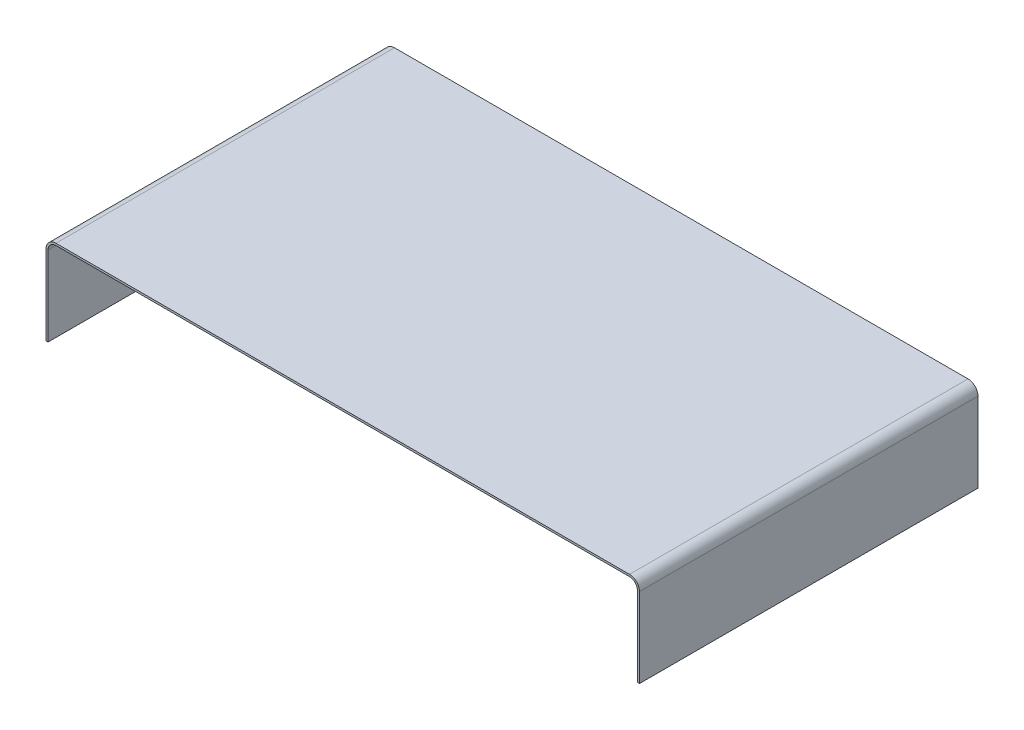
ISO-10303-21;
HEADER;
FILE_DESCRIPTION(('STEP AP214'),'2;1');
FILE_NAME('part.step','',(''),(''),'','','');
FILE_SCHEMA(('AUTOMOTIVE_DESIGN { 1 0 10303 214 1 1 1 1 }'));
ENDSEC;
DATA;
#1=APPLICATION_CONTEXT('core data for automotive mechanical design processes');
#2=APPLICATION_PROTOCOL_DEFINITION('international standard','automotive_design',2000,#1);
#3=PRODUCT_CONTEXT('',#1,'mechanical');
#4=PRODUCT('Part','Part','',(#3));
#5=PRODUCT_RELATED_PRODUCT_CATEGORY('part','',(#4));
#6=PRODUCT_DEFINITION_FORMATION('','',#4);
#7=PRODUCT_DEFINITION_CONTEXT('part definition',#1,'design');
#8=PRODUCT_DEFINITION('design','',#6,#7);
#9=PRODUCT_DEFINITION_SHAPE('','',#8);
#10=(LENGTH_UNIT() NAMED_UNIT(*) SI_UNIT(.MILLI.,.METRE.));
#11=(NAMED_UNIT(*) PLANE_ANGLE_UNIT() SI_UNIT($,.RADIAN.));
#12=(NAMED_UNIT(*) SI_UNIT($,.STERADIAN.) SOLID_ANGLE_UNIT());
#13=UNCERTAINTY_MEASURE_WITH_UNIT(LENGTH_MEASURE(1.E-05),#10,'distance_accuracy_value','');
#14=(GEOMETRIC_REPRESENTATION_CONTEXT(3) GLOBAL_UNCERTAINTY_ASSIGNED_CONTEXT((#13)) GLOBAL_UNIT_ASSIGNED_CONTEXT((#10,
#11,#12)) REPRESENTATION_CONTEXT('',''));
#15=CARTESIAN_POINT('',(0.,0.,0.));
#16=DIRECTION('',(0.,0.,1.));
#17=DIRECTION('',(1.,0.,0.));
#18=AXIS2_PLACEMENT_3D('',#15,#16,#17);
#19=CARTESIAN_POINT('',(0.,0.,170.));
#20=DIRECTION('',(0.,1.,0.));
#21=DIRECTION('',(0.,0.,1.));
#22=AXIS2_PLACEMENT_3D('',#19,#20,#21);
#23=PLANE('',#22);
#24=DIRECTION('',(1.,0.,0.));
#25=VECTOR('',#24,1.);
#26=CARTESIAN_POINT('',(0.,0.,0.));
#27=LINE('',#26,#25);
#28=CARTESIAN_POINT('',(0.,0.,0.));
#29=VERTEX_POINT('',#28);
#30=CARTESIAN_POINT('',(1.,0.,0.));
#31=VERTEX_POINT('',#30);
#32=EDGE_CURVE('E155',#29,#31,#27,.T.);
#33=ORIENTED_EDGE('',*,*,#32,.T.);
#34=DIRECTION('',(0.,0.,-1.));
#35=VECTOR('',#34,1.);
#36=CARTESIAN_POINT('',(1.,0.,170.));
#37=LINE('',#36,#35);
#38=CARTESIAN_POINT('',(1.,0.,170.));
#39=VERTEX_POINT('',#38);
#40=EDGE_CURVE('E11',#39,#31,#37,.T.);
#41=ORIENTED_EDGE('',*,*,#40,.F.);
#42=DIRECTION('',(1.,0.,0.));
#43=VECTOR('',#42,1.);
#44=CARTESIAN_POINT('',(0.,0.,170.));
#45=LINE('',#44,#43);
#46=CARTESIAN_POINT('',(0.,0.,170.));
#47=VERTEX_POINT('',#46);
#48=EDGE_CURVE('E177',#47,#39,#45,.T.);
#49=ORIENTED_EDGE('',*,*,#48,.F.);
#50=DIRECTION('',(0.,0.,-1.));
#51=VECTOR('',#50,1.);
#52=CARTESIAN_POINT('',(0.,0.,170.));
#53=LINE('',#52,#51);
#54=EDGE_CURVE('E151',#47,#29,#53,.T.);
#55=ORIENTED_EDGE('',*,*,#54,.T.);
#56=EDGE_LOOP('',(#33,#41,#49,#55));
#57=FACE_BOUND('',#56,.T.);
#58=ADVANCED_FACE('F35',(#57),#23,.F.);
#59=CARTESIAN_POINT('',(1.,0.,170.));
#60=DIRECTION('',(-1.,0.,0.));
#61=DIRECTION('',(0.,-1.,0.));
#62=AXIS2_PLACEMENT_3D('',#59,#60,#61);
#63=PLANE('',#62);
#64=DIRECTION('',(0.,1.,0.));
#65=VECTOR('',#64,1.);
#66=CARTESIAN_POINT('',(1.,0.,0.));
#67=LINE('',#66,#65);
#68=CARTESIAN_POINT('',(0.999999999999988,40.,0.));
#69=VERTEX_POINT('',#68);
#70=EDGE_CURVE('E158',#31,#69,#67,.T.);
#71=ORIENTED_EDGE('',*,*,#70,.T.);
#72=DIRECTION('',(0.,0.,-1.));
#73=VECTOR('',#72,1.);
#74=CARTESIAN_POINT('',(0.999999999999988,40.,170.));
#75=LINE('',#74,#73);
#76=CARTESIAN_POINT('',(0.999999999999988,40.,170.));
#77=VERTEX_POINT('',#76);
#78=EDGE_CURVE('E43',#77,#69,#75,.T.);
#79=ORIENTED_EDGE('',*,*,#78,.F.);
#80=DIRECTION('',(0.,1.,0.));
#81=VECTOR('',#80,1.);
#82=CARTESIAN_POINT('',(1.,0.,170.));
#83=LINE('',#82,#81);
#84=EDGE_CURVE('E106',#39,#77,#83,.T.);
#85=ORIENTED_EDGE('',*,*,#84,.F.);
#86=ORIENTED_EDGE('',*,*,#40,.T.);
#87=EDGE_LOOP('',(#71,#79,#85,#86));
#88=FACE_BOUND('',#87,.T.);
#89=ADVANCED_FACE('F255',(#88),#63,.F.);
#90=CARTESIAN_POINT('',(5.,40.,170.));
#91=DIRECTION('',(0.,0.,-1.));
#92=DIRECTION('',(-1.,0.,0.));
#93=AXIS2_PLACEMENT_3D('',#90,#91,#92);
#94=CYLINDRICAL_SURFACE('',#93,4.00000000000001);
#95=CARTESIAN_POINT('',(5.,40.,0.));
#96=DIRECTION('',(0.,0.,-1.));
#97=DIRECTION('',(1.,0.,0.));
#98=AXIS2_PLACEMENT_3D('',#95,#96,#97);
#99=CIRCLE('',#98,4.00000000000001);
#100=CARTESIAN_POINT('',(5.00000000000006,44.,0.));
#101=VERTEX_POINT('',#100);
#102=EDGE_CURVE('E160',#69,#101,#99,.T.);
#103=ORIENTED_EDGE('',*,*,#102,.T.);
#104=DIRECTION('',(0.,0.,-1.));
#105=VECTOR('',#104,1.);
#106=CARTESIAN_POINT('',(5.00000000000006,44.,170.));
#107=LINE('',#106,#105);
#108=CARTESIAN_POINT('',(5.00000000000006,44.,170.));
#109=VERTEX_POINT('',#108);
#110=EDGE_CURVE('E196',#109,#101,#107,.T.);
#111=ORIENTED_EDGE('',*,*,#110,.F.);
#112=CARTESIAN_POINT('',(5.,40.,170.));
#113=DIRECTION('',(0.,0.,-1.));
#114=DIRECTION('',(1.,0.,0.));
#115=AXIS2_PLACEMENT_3D('',#112,#113,#114);
#116=CIRCLE('',#115,4.00000000000001);
#117=EDGE_CURVE('E204',#77,#109,#116,.T.);
#118=ORIENTED_EDGE('',*,*,#117,.F.);
#119=ORIENTED_EDGE('',*,*,#78,.T.);
#120=EDGE_LOOP('',(#103,#111,#118,#119));
#121=FACE_BOUND('',#120,.T.);
#122=ADVANCED_FACE('F202',(#121),#94,.F.);
#123=CARTESIAN_POINT('',(293.,44.,170.));
#124=DIRECTION('',(0.,1.,0.));
#125=DIRECTION('',(-1.,0.,0.));
#126=AXIS2_PLACEMENT_3D('',#123,#124,#125);
#127=PLANE('',#126);
#128=DIRECTION('',(1.,0.,0.));
#129=VECTOR('',#128,1.);
#130=CARTESIAN_POINT('',(293.,44.,0.));
#131=LINE('',#130,#129);
#132=CARTESIAN_POINT('',(293.,44.,0.));
#133=VERTEX_POINT('',#132);
#134=EDGE_CURVE('E162',#101,#133,#131,.T.);
#135=ORIENTED_EDGE('',*,*,#134,.T.);
#136=DIRECTION('',(0.,0.,-1.));
#137=VECTOR('',#136,1.);
#138=CARTESIAN_POINT('',(293.,44.,170.));
#139=LINE('',#138,#137);
#140=CARTESIAN_POINT('',(293.,44.,170.));
#141=VERTEX_POINT('',#140);
#142=EDGE_CURVE('E193',#141,#133,#139,.T.);
#143=ORIENTED_EDGE('',*,*,#142,.F.);
#144=DIRECTION('',(1.,0.,0.));
#145=VECTOR('',#144,1.);
#146=CARTESIAN_POINT('',(293.,44.,170.));
#147=LINE('',#146,#145);
#148=EDGE_CURVE('E222',#109,#141,#147,.T.);
#149=ORIENTED_EDGE('',*,*,#148,.F.);
#150=ORIENTED_EDGE('',*,*,#110,.T.);
#151=EDGE_LOOP('',(#135,#143,#149,#150));
#152=FACE_BOUND('',#151,.T.);
#153=ADVANCED_FACE('F213',(#152),#127,.F.);
#154=CARTESIAN_POINT('',(293.,40.,170.));
#155=DIRECTION('',(0.,0.,-1.));
#156=DIRECTION('',(-1.,0.,0.));
#157=AXIS2_PLACEMENT_3D('',#154,#155,#156);
#158=CYLINDRICAL_SURFACE('',#157,4.);
#159=CARTESIAN_POINT('',(293.,40.,0.));
#160=DIRECTION('',(0.,0.,-1.));
#161=DIRECTION('',(-1.,0.,0.));
#162=AXIS2_PLACEMENT_3D('',#159,#160,#161);
#163=CIRCLE('',#162,4.);
#164=CARTESIAN_POINT('',(297.,40.,0.));
#165=VERTEX_POINT('',#164);
#166=EDGE_CURVE('E164',#133,#165,#163,.T.);
#167=ORIENTED_EDGE('',*,*,#166,.T.);
#168=DIRECTION('',(0.,0.,-1.));
#169=VECTOR('',#168,1.);
#170=CARTESIAN_POINT('',(297.,40.,170.));
#171=LINE('',#170,#169);
#172=CARTESIAN_POINT('',(297.,40.,170.));
#173=VERTEX_POINT('',#172);
#174=EDGE_CURVE('E190',#173,#165,#171,.T.);
#175=ORIENTED_EDGE('',*,*,#174,.F.);
#176=CARTESIAN_POINT('',(293.,40.,170.));
#177=DIRECTION('',(0.,0.,-1.));
#178=DIRECTION('',(-1.,0.,0.));
#179=AXIS2_PLACEMENT_3D('',#176,#177,#178);
#180=CIRCLE('',#179,4.);
#181=EDGE_CURVE('E219',#141,#173,#180,.T.);
#182=ORIENTED_EDGE('',*,*,#181,.F.);
#183=ORIENTED_EDGE('',*,*,#142,.T.);
#184=EDGE_LOOP('',(#167,#175,#182,#183));
#185=FACE_BOUND('',#184,.T.);
#186=ADVANCED_FACE('F217',(#185),#158,.F.);
#187=CARTESIAN_POINT('',(297.,0.,170.));
#188=DIRECTION('',(1.,0.,0.));
#189=DIRECTION('',(0.,0.,-1.));
#190=AXIS2_PLACEMENT_3D('',#187,#188,#189);
#191=PLANE('',#190);
#192=DIRECTION('',(0.,-1.,0.));
#193=VECTOR('',#192,1.);
#194=CARTESIAN_POINT('',(297.,0.,0.));
#195=LINE('',#194,#193);
#196=CARTESIAN_POINT('',(297.,0.,0.));
#197=VERTEX_POINT('',#196);
#198=EDGE_CURVE('E166',#165,#197,#195,.T.);
#199=ORIENTED_EDGE('',*,*,#198,.T.);
#200=DIRECTION('',(0.,0.,-1.));
#201=VECTOR('',#200,1.);
#202=CARTESIAN_POINT('',(297.,0.,170.));
#203=LINE('',#202,#201);
#204=CARTESIAN_POINT('',(297.,0.,170.));
#205=VERTEX_POINT('',#204);
#206=EDGE_CURVE('E187',#205,#197,#203,.T.);
#207=ORIENTED_EDGE('',*,*,#206,.F.);
#208=DIRECTION('',(0.,-1.,0.));
#209=VECTOR('',#208,1.);
#210=CARTESIAN_POINT('',(297.,0.,170.));
#211=LINE('',#210,#209);
#212=EDGE_CURVE('E221',#173,#205,#211,.T.);
#213=ORIENTED_EDGE('',*,*,#212,.F.);
#214=ORIENTED_EDGE('',*,*,#174,.T.);
#215=EDGE_LOOP('',(#199,#207,#213,#214));
#216=FACE_BOUND('',#215,.T.);
#217=ADVANCED_FACE('F268',(#216),#191,.F.);
#218=CARTESIAN_POINT('',(297.,0.,170.));
#219=DIRECTION('',(0.,1.,0.));
#220=DIRECTION('',(0.,0.,1.));
#221=AXIS2_PLACEMENT_3D('',#218,#219,#220);
#222=PLANE('',#221);
#223=DIRECTION('',(1.,0.,0.));
#224=VECTOR('',#223,1.);
#225=CARTESIAN_POINT('',(297.,0.,0.));
#226=LINE('',#225,#224);
#227=CARTESIAN_POINT('',(298.,0.,0.));
#228=VERTEX_POINT('',#227);
#229=EDGE_CURVE('E168',#197,#228,#226,.T.);
#230=ORIENTED_EDGE('',*,*,#229,.T.);
#231=DIRECTION('',(0.,0.,-1.));
#232=VECTOR('',#231,1.);
#233=CARTESIAN_POINT('',(298.,0.,170.));
#234=LINE('',#233,#232);
#235=CARTESIAN_POINT('',(298.,0.,170.));
#236=VERTEX_POINT('',#235);
#237=EDGE_CURVE('E184',#236,#228,#234,.T.);
#238=ORIENTED_EDGE('',*,*,#237,.F.);
#239=DIRECTION('',(1.,0.,0.));
#240=VECTOR('',#239,1.);
#241=CARTESIAN_POINT('',(297.,0.,170.));
#242=LINE('',#241,#240);
#243=EDGE_CURVE('E224',#205,#236,#242,.T.);
#244=ORIENTED_EDGE('',*,*,#243,.F.);
#245=ORIENTED_EDGE('',*,*,#206,.T.);
#246=EDGE_LOOP('',(#230,#238,#244,#245));
#247=FACE_BOUND('',#246,.T.);
#248=ADVANCED_FACE('F271',(#247),#222,.F.);
#249=CARTESIAN_POINT('',(298.,0.,170.));
#250=DIRECTION('',(-1.,0.,0.));
#251=DIRECTION('',(0.,0.,1.));
#252=AXIS2_PLACEMENT_3D('',#249,#250,#251);
#253=PLANE('',#252);
#254=DIRECTION('',(0.,1.,0.));
#255=VECTOR('',#254,1.);
#256=CARTESIAN_POINT('',(298.,0.,0.));
#257=LINE('',#256,#255);
#258=CARTESIAN_POINT('',(298.,40.,0.));
#259=VERTEX_POINT('',#258);
#260=EDGE_CURVE('E170',#228,#259,#257,.T.);
#261=ORIENTED_EDGE('',*,*,#260,.T.);
#262=DIRECTION('',(0.,0.,-1.));
#263=VECTOR('',#262,1.);
#264=CARTESIAN_POINT('',(298.,40.,170.));
#265=LINE('',#264,#263);
#266=CARTESIAN_POINT('',(298.,40.,170.));
#267=VERTEX_POINT('',#266);
#268=EDGE_CURVE('E181',#267,#259,#265,.T.);
#269=ORIENTED_EDGE('',*,*,#268,.F.);
#270=DIRECTION('',(0.,1.,0.));
#271=VECTOR('',#270,1.);
#272=CARTESIAN_POINT('',(298.,0.,170.));
#273=LINE('',#272,#271);
#274=EDGE_CURVE('E230',#236,#267,#273,.T.);
#275=ORIENTED_EDGE('',*,*,#274,.F.);
#276=ORIENTED_EDGE('',*,*,#237,.T.);
#277=EDGE_LOOP('',(#261,#269,#275,#276));
#278=FACE_BOUND('',#277,.T.);
#279=ADVANCED_FACE('F236',(#278),#253,.F.);
#280=CARTESIAN_POINT('',(293.,40.,170.));
#281=DIRECTION('',(0.,0.,-1.));
#282=DIRECTION('',(-1.,0.,0.));
#283=AXIS2_PLACEMENT_3D('',#280,#281,#282);
#284=CYLINDRICAL_SURFACE('',#283,5.);
#285=CARTESIAN_POINT('',(293.,40.,0.));
#286=DIRECTION('',(0.,0.,1.));
#287=DIRECTION('',(-1.,0.,0.));
#288=AXIS2_PLACEMENT_3D('',#285,#286,#287);
#289=CIRCLE('',#288,5.);
#290=CARTESIAN_POINT('',(293.,45.,0.));
#291=VERTEX_POINT('',#290);
#292=EDGE_CURVE('E172',#259,#291,#289,.T.);
#293=ORIENTED_EDGE('',*,*,#292,.T.);
#294=DIRECTION('',(0.,0.,-1.));
#295=VECTOR('',#294,1.);
#296=CARTESIAN_POINT('',(293.,45.,170.));
#297=LINE('',#296,#295);
#298=CARTESIAN_POINT('',(293.,45.,170.));
#299=VERTEX_POINT('',#298);
#300=EDGE_CURVE('E146',#299,#291,#297,.T.);
#301=ORIENTED_EDGE('',*,*,#300,.F.);
#302=CARTESIAN_POINT('',(293.,40.,170.));
#303=DIRECTION('',(0.,0.,1.));
#304=DIRECTION('',(-1.,0.,0.));
#305=AXIS2_PLACEMENT_3D('',#302,#303,#304);
#306=CIRCLE('',#305,5.);
#307=EDGE_CURVE('E137',#267,#299,#306,.T.);
#308=ORIENTED_EDGE('',*,*,#307,.F.);
#309=ORIENTED_EDGE('',*,*,#268,.T.);
#310=EDGE_LOOP('',(#293,#301,#308,#309));
#311=FACE_BOUND('',#310,.T.);
#312=ADVANCED_FACE('F240',(#311),#284,.T.);
#313=CARTESIAN_POINT('',(293.,45.,170.));
#314=DIRECTION('',(0.,-1.,0.));
#315=DIRECTION('',(1.,0.,0.));
#316=AXIS2_PLACEMENT_3D('',#313,#314,#315);
#317=PLANE('',#316);
#318=DIRECTION('',(-1.,0.,0.));
#319=VECTOR('',#318,1.);
#320=CARTESIAN_POINT('',(293.,45.,0.));
#321=LINE('',#320,#319);
#322=CARTESIAN_POINT('',(5.00000000000004,45.,0.));
#323=VERTEX_POINT('',#322);
#324=EDGE_CURVE('E145',#291,#323,#321,.T.);
#325=ORIENTED_EDGE('',*,*,#324,.T.);
#326=DIRECTION('',(0.,0.,-1.));
#327=VECTOR('',#326,1.);
#328=CARTESIAN_POINT('',(5.00000000000004,45.,170.));
#329=LINE('',#328,#327);
#330=CARTESIAN_POINT('',(5.00000000000004,45.,170.));
#331=VERTEX_POINT('',#330);
#332=EDGE_CURVE('E142',#331,#323,#329,.T.);
#333=ORIENTED_EDGE('',*,*,#332,.F.);
#334=DIRECTION('',(-1.,0.,0.));
#335=VECTOR('',#334,1.);
#336=CARTESIAN_POINT('',(293.,45.,170.));
#337=LINE('',#336,#335);
#338=EDGE_CURVE('E131',#299,#331,#337,.T.);
#339=ORIENTED_EDGE('',*,*,#338,.F.);
#340=ORIENTED_EDGE('',*,*,#300,.T.);
#341=EDGE_LOOP('',(#325,#333,#339,#340));
#342=FACE_BOUND('',#341,.T.);
#343=ADVANCED_FACE('F143',(#342),#317,.F.);
#344=CARTESIAN_POINT('',(5.,40.,170.));
#345=DIRECTION('',(0.,0.,-1.));
#346=DIRECTION('',(-1.,0.,0.));
#347=AXIS2_PLACEMENT_3D('',#344,#345,#346);
#348=CYLINDRICAL_SURFACE('',#347,5.);
#349=CARTESIAN_POINT('',(5.,40.,0.));
#350=DIRECTION('',(0.,0.,1.));
#351=DIRECTION('',(1.,0.,0.));
#352=AXIS2_PLACEMENT_3D('',#349,#350,#351);
#353=CIRCLE('',#352,5.);
#354=CARTESIAN_POINT('',(0.,40.,0.));
#355=VERTEX_POINT('',#354);
#356=EDGE_CURVE('E92',#323,#355,#353,.T.);
#357=ORIENTED_EDGE('',*,*,#356,.T.);
#358=DIRECTION('',(0.,0.,-1.));
#359=VECTOR('',#358,1.);
#360=CARTESIAN_POINT('',(0.,40.,170.));
#361=LINE('',#360,#359);
#362=CARTESIAN_POINT('',(0.,40.,170.));
#363=VERTEX_POINT('',#362);
#364=EDGE_CURVE('E147',#363,#355,#361,.T.);
#365=ORIENTED_EDGE('',*,*,#364,.F.);
#366=CARTESIAN_POINT('',(5.,40.,170.));
#367=DIRECTION('',(0.,0.,1.));
#368=DIRECTION('',(1.,0.,0.));
#369=AXIS2_PLACEMENT_3D('',#366,#367,#368);
#370=CIRCLE('',#369,5.);
#371=EDGE_CURVE('E135',#331,#363,#370,.T.);
#372=ORIENTED_EDGE('',*,*,#371,.F.);
#373=ORIENTED_EDGE('',*,*,#332,.T.);
#374=EDGE_LOOP('',(#357,#365,#372,#373));
#375=FACE_BOUND('',#374,.T.);
#376=ADVANCED_FACE('F149',(#375),#348,.T.);
#377=CARTESIAN_POINT('',(0.,0.,170.));
#378=DIRECTION('',(1.,0.,0.));
#379=DIRECTION('',(0.,0.,-1.));
#380=AXIS2_PLACEMENT_3D('',#377,#378,#379);
#381=PLANE('',#380);
#382=DIRECTION('',(0.,-1.,0.));
#383=VECTOR('',#382,1.);
#384=CARTESIAN_POINT('',(0.,0.,0.));
#385=LINE('',#384,#383);
#386=EDGE_CURVE('E98',#355,#29,#385,.T.);
#387=ORIENTED_EDGE('',*,*,#386,.T.);
#388=ORIENTED_EDGE('',*,*,#54,.F.);
#389=DIRECTION('',(0.,-1.,0.));
#390=VECTOR('',#389,1.);
#391=CARTESIAN_POINT('',(0.,0.,170.));
#392=LINE('',#391,#390);
#393=EDGE_CURVE('E51',#363,#47,#392,.T.);
#394=ORIENTED_EDGE('',*,*,#393,.F.);
#395=ORIENTED_EDGE('',*,*,#364,.T.);
#396=EDGE_LOOP('',(#387,#388,#394,#395));
#397=FACE_BOUND('',#396,.T.);
#398=ADVANCED_FACE('F244',(#397),#381,.F.);
#399=CARTESIAN_POINT('',(5.,40.,170.));
#400=DIRECTION('',(0.,0.,1.));
#401=DIRECTION('',(1.,0.,0.));
#402=AXIS2_PLACEMENT_3D('',#399,#400,#401);
#403=PLANE('',#402);
#404=ORIENTED_EDGE('',*,*,#48,.T.);
#405=ORIENTED_EDGE('',*,*,#84,.T.);
#406=ORIENTED_EDGE('',*,*,#117,.T.);
#407=ORIENTED_EDGE('',*,*,#148,.T.);
#408=ORIENTED_EDGE('',*,*,#181,.T.);
#409=ORIENTED_EDGE('',*,*,#212,.T.);
#410=ORIENTED_EDGE('',*,*,#243,.T.);
#411=ORIENTED_EDGE('',*,*,#274,.T.);
#412=ORIENTED_EDGE('',*,*,#307,.T.);
#413=ORIENTED_EDGE('',*,*,#338,.T.);
#414=ORIENTED_EDGE('',*,*,#371,.T.);
#415=ORIENTED_EDGE('',*,*,#393,.T.);
#416=EDGE_LOOP('',(#404,#405,#406,#407,#408,#409,#410,#411,#412,#413,#414,#415));
#417=FACE_BOUND('',#416,.T.);
#418=ADVANCED_FACE('F133',(#417),#403,.T.);
#419=CARTESIAN_POINT('',(5.,40.,0.));
#420=DIRECTION('',(0.,0.,1.));
#421=DIRECTION('',(1.,0.,0.));
#422=AXIS2_PLACEMENT_3D('',#419,#420,#421);
#423=PLANE('',#422);
#424=ORIENTED_EDGE('',*,*,#32,.F.);
#425=ORIENTED_EDGE('',*,*,#386,.F.);
#426=ORIENTED_EDGE('',*,*,#356,.F.);
#427=ORIENTED_EDGE('',*,*,#324,.F.);
#428=ORIENTED_EDGE('',*,*,#292,.F.);
#429=ORIENTED_EDGE('',*,*,#260,.F.);
#430=ORIENTED_EDGE('',*,*,#229,.F.);
#431=ORIENTED_EDGE('',*,*,#198,.F.);
#432=ORIENTED_EDGE('',*,*,#166,.F.);
#433=ORIENTED_EDGE('',*,*,#134,.F.);
#434=ORIENTED_EDGE('',*,*,#102,.F.);
#435=ORIENTED_EDGE('',*,*,#70,.F.);
#436=EDGE_LOOP('',(#424,#425,#426,#427,#428,#429,#430,#431,#432,#433,#434,#435));
#437=FACE_BOUND('',#436,.T.);
#438=ADVANCED_FACE('F208',(#437),#423,.F.);
#439=CLOSED_SHELL('',(#58,#89,#122,#153,#186,#217,#248,#279,#312,#343,#376,#398,#418,#438));
#440=MANIFOLD_SOLID_BREP('B2',#439);
#441=ADVANCED_BREP_SHAPE_REPRESENTATION('',(#18,#440),#14);
#442=SHAPE_DEFINITION_REPRESENTATION(#9,#441);
ENDSEC;
END-ISO-10303-21;
